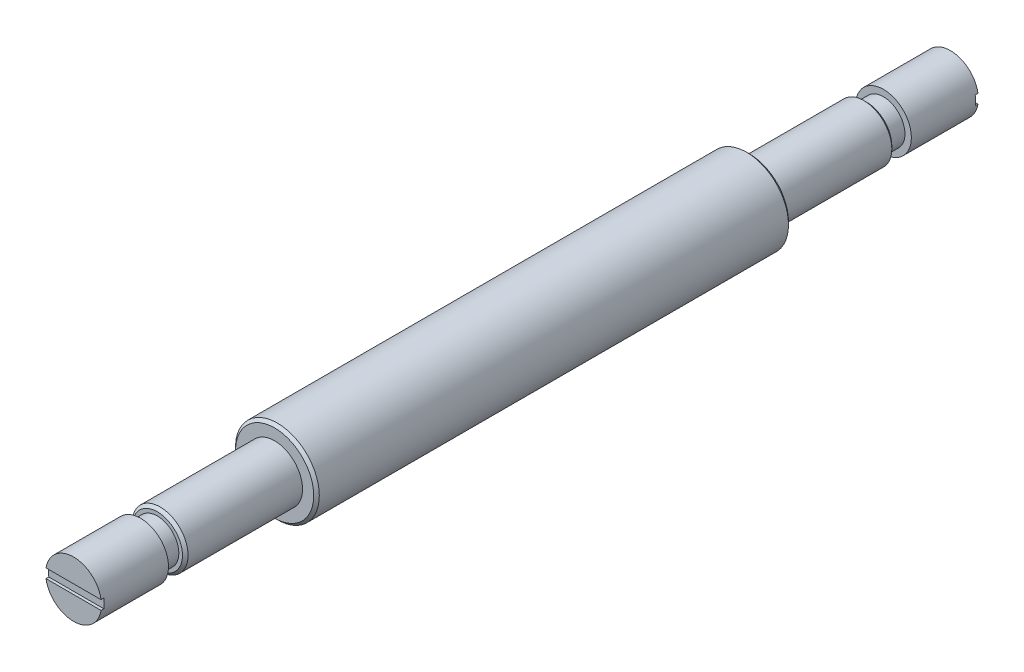
ISO-10303-21;
HEADER;
FILE_DESCRIPTION(('STEP AP214'),'2;1');
FILE_NAME('part.step','',(''),(''),'','','');
FILE_SCHEMA(('AUTOMOTIVE_DESIGN { 1 0 10303 214 1 1 1 1 }'));
ENDSEC;
DATA;
#1=APPLICATION_CONTEXT('core data for automotive mechanical design processes');
#2=APPLICATION_PROTOCOL_DEFINITION('international standard','automotive_design',2000,#1);
#3=PRODUCT_CONTEXT('',#1,'mechanical');
#4=PRODUCT('Part','Part','',(#3));
#5=PRODUCT_RELATED_PRODUCT_CATEGORY('part','',(#4));
#6=PRODUCT_DEFINITION_FORMATION('','',#4);
#7=PRODUCT_DEFINITION_CONTEXT('part definition',#1,'design');
#8=PRODUCT_DEFINITION('design','',#6,#7);
#9=PRODUCT_DEFINITION_SHAPE('','',#8);
#10=(LENGTH_UNIT() NAMED_UNIT(*) SI_UNIT(.MILLI.,.METRE.));
#11=(NAMED_UNIT(*) PLANE_ANGLE_UNIT() SI_UNIT($,.RADIAN.));
#12=(NAMED_UNIT(*) SI_UNIT($,.STERADIAN.) SOLID_ANGLE_UNIT());
#13=UNCERTAINTY_MEASURE_WITH_UNIT(LENGTH_MEASURE(1.E-05),#10,'distance_accuracy_value','');
#14=(GEOMETRIC_REPRESENTATION_CONTEXT(3) GLOBAL_UNCERTAINTY_ASSIGNED_CONTEXT((#13)) GLOBAL_UNIT_ASSIGNED_CONTEXT((#10,
#11,#12)) REPRESENTATION_CONTEXT('',''));
#15=CARTESIAN_POINT('',(0.,0.,0.));
#16=DIRECTION('',(0.,0.,1.));
#17=DIRECTION('',(1.,0.,0.));
#18=AXIS2_PLACEMENT_3D('',#15,#16,#17);
#19=CARTESIAN_POINT('',(0.,0.,78.5));
#20=DIRECTION('',(0.,0.,1.));
#21=DIRECTION('',(1.,0.,0.));
#22=AXIS2_PLACEMENT_3D('',#19,#20,#21);
#23=PLANE('',#22);
#24=CARTESIAN_POINT('',(0.,0.,78.5));
#25=DIRECTION('',(0.,0.,1.));
#26=DIRECTION('',(1.,0.,0.));
#27=AXIS2_PLACEMENT_3D('',#24,#25,#26);
#28=CIRCLE('',#27,5.);
#29=CARTESIAN_POINT('',(4.93036641759883,0.831556966306978,78.5));
#30=VERTEX_POINT('',#29);
#31=CARTESIAN_POINT('',(-4.93036641759883,0.831556966306978,78.5));
#32=VERTEX_POINT('',#31);
#33=EDGE_CURVE('E119',#30,#32,#28,.T.);
#34=ORIENTED_EDGE('',*,*,#33,.T.);
#35=DIRECTION('',(1.,0.,0.));
#36=VECTOR('',#35,1.);
#37=CARTESIAN_POINT('',(5.83331006214958,0.831556966306978,78.5));
#38=LINE('',#37,#36);
#39=EDGE_CURVE('E110',#32,#30,#38,.T.);
#40=ORIENTED_EDGE('',*,*,#39,.T.);
#41=EDGE_LOOP('',(#34,#40));
#42=FACE_BOUND('',#41,.T.);
#43=ADVANCED_FACE('F37',(#42),#23,.T.);
#44=CARTESIAN_POINT('',(-4.93036641759883,-0.831556966306978,78.5));
#45=VERTEX_POINT('',#44);
#46=CARTESIAN_POINT('',(4.93036641759883,-0.831556966306978,78.5));
#47=VERTEX_POINT('',#46);
#48=EDGE_CURVE('E116',#45,#47,#28,.T.);
#49=ORIENTED_EDGE('',*,*,#48,.T.);
#50=DIRECTION('',(-1.,0.,0.));
#51=VECTOR('',#50,1.);
#52=CARTESIAN_POINT('',(5.83331006214958,-0.831556966306978,78.5));
#53=LINE('',#52,#51);
#54=EDGE_CURVE('E100',#47,#45,#53,.T.);
#55=ORIENTED_EDGE('',*,*,#54,.T.);
#56=EDGE_LOOP('',(#49,#55));
#57=FACE_BOUND('',#56,.T.);
#58=ADVANCED_FACE('F118',(#57),#23,.T.);
#59=CARTESIAN_POINT('',(0.,0.,42.5));
#60=DIRECTION('',(0.,0.,1.));
#61=DIRECTION('',(1.,0.,0.));
#62=AXIS2_PLACEMENT_3D('',#59,#60,#61);
#63=CYLINDRICAL_SURFACE('',#62,5.);
#64=CARTESIAN_POINT('',(0.,0.,66.5));
#65=DIRECTION('',(0.,0.,1.));
#66=DIRECTION('',(1.,0.,0.));
#67=AXIS2_PLACEMENT_3D('',#64,#65,#66);
#68=CIRCLE('',#67,5.);
#69=CARTESIAN_POINT('',(5.,0.,66.5));
#70=VERTEX_POINT('',#69);
#71=EDGE_CURVE('E120',#70,#70,#68,.T.);
#72=ORIENTED_EDGE('',*,*,#71,.T.);
#73=EDGE_LOOP('',(#72));
#74=FACE_BOUND('',#73,.T.);
#75=DIRECTION('',(0.,0.,1.));
#76=VECTOR('',#75,1.);
#77=CARTESIAN_POINT('',(4.93036641759883,0.831556966306978,42.5));
#78=LINE('',#77,#76);
#79=CARTESIAN_POINT('',(4.93036641759883,0.831556966306978,78.));
#80=VERTEX_POINT('',#79);
#81=EDGE_CURVE('E11',#80,#30,#78,.T.);
#82=ORIENTED_EDGE('',*,*,#81,.F.);
#83=CARTESIAN_POINT('',(0.,0.,78.));
#84=DIRECTION('',(0.,0.,-1.));
#85=DIRECTION('',(-1.,0.,0.));
#86=AXIS2_PLACEMENT_3D('',#83,#84,#85);
#87=CIRCLE('',#86,5.);
#88=CARTESIAN_POINT('',(4.93036641759883,-0.831556966306978,78.));
#89=VERTEX_POINT('',#88);
#90=EDGE_CURVE('E117',#80,#89,#87,.T.);
#91=ORIENTED_EDGE('',*,*,#90,.T.);
#92=DIRECTION('',(0.,0.,1.));
#93=VECTOR('',#92,1.);
#94=CARTESIAN_POINT('',(4.93036641759883,-0.831556966306978,42.5));
#95=LINE('',#94,#93);
#96=EDGE_CURVE('E45',#47,#89,#95,.F.);
#97=ORIENTED_EDGE('',*,*,#96,.F.);
#98=ORIENTED_EDGE('',*,*,#48,.F.);
#99=DIRECTION('',(0.,0.,1.));
#100=VECTOR('',#99,1.);
#101=CARTESIAN_POINT('',(-4.93036641759883,-0.831556966306978,42.5));
#102=LINE('',#101,#100);
#103=CARTESIAN_POINT('',(-4.93036641759883,-0.831556966306978,78.));
#104=VERTEX_POINT('',#103);
#105=EDGE_CURVE('E106',#104,#45,#102,.T.);
#106=ORIENTED_EDGE('',*,*,#105,.F.);
#107=CARTESIAN_POINT('',(-4.93036641759883,0.831556966306978,78.));
#108=VERTEX_POINT('',#107);
#109=EDGE_CURVE('E165',#104,#108,#87,.T.);
#110=ORIENTED_EDGE('',*,*,#109,.T.);
#111=DIRECTION('',(0.,0.,1.));
#112=VECTOR('',#111,1.);
#113=CARTESIAN_POINT('',(-4.93036641759883,0.831556966306978,42.5));
#114=LINE('',#113,#112);
#115=EDGE_CURVE('E169',#32,#108,#114,.F.);
#116=ORIENTED_EDGE('',*,*,#115,.F.);
#117=ORIENTED_EDGE('',*,*,#33,.F.);
#118=EDGE_LOOP('',(#82,#91,#97,#98,#106,#110,#116,#117));
#119=FACE_BOUND('',#118,.T.);
#120=ADVANCED_FACE('F115',(#74,#119),#63,.T.);
#121=CARTESIAN_POINT('',(0.,0.,-78.5));
#122=DIRECTION('',(0.,0.,1.));
#123=DIRECTION('',(1.,0.,0.));
#124=AXIS2_PLACEMENT_3D('',#121,#122,#123);
#125=PLANE('',#124);
#126=CARTESIAN_POINT('',(0.,0.,-78.5));
#127=DIRECTION('',(0.,0.,1.));
#128=DIRECTION('',(1.,0.,0.));
#129=AXIS2_PLACEMENT_3D('',#126,#127,#128);
#130=CIRCLE('',#129,5.);
#131=CARTESIAN_POINT('',(-4.93036641759883,-0.831556966306978,-78.5));
#132=VERTEX_POINT('',#131);
#133=CARTESIAN_POINT('',(4.93036641759883,-0.831556966306978,-78.5));
#134=VERTEX_POINT('',#133);
#135=EDGE_CURVE('E207',#132,#134,#130,.T.);
#136=ORIENTED_EDGE('',*,*,#135,.F.);
#137=DIRECTION('',(-1.,0.,0.));
#138=VECTOR('',#137,1.);
#139=CARTESIAN_POINT('',(5.83331006214958,-0.831556966306978,-78.5));
#140=LINE('',#139,#138);
#141=EDGE_CURVE('E183',#134,#132,#140,.T.);
#142=ORIENTED_EDGE('',*,*,#141,.F.);
#143=EDGE_LOOP('',(#136,#142));
#144=FACE_BOUND('',#143,.T.);
#145=ADVANCED_FACE('F223',(#144),#125,.F.);
#146=CARTESIAN_POINT('',(4.93036641759883,0.831556966306978,-78.5));
#147=VERTEX_POINT('',#146);
#148=CARTESIAN_POINT('',(-4.93036641759883,0.831556966306978,-78.5));
#149=VERTEX_POINT('',#148);
#150=EDGE_CURVE('E133',#147,#149,#130,.T.);
#151=ORIENTED_EDGE('',*,*,#150,.F.);
#152=DIRECTION('',(1.,0.,0.));
#153=VECTOR('',#152,1.);
#154=CARTESIAN_POINT('',(5.83331006214958,0.831556966306978,-78.5));
#155=LINE('',#154,#153);
#156=EDGE_CURVE('E178',#149,#147,#155,.T.);
#157=ORIENTED_EDGE('',*,*,#156,.F.);
#158=EDGE_LOOP('',(#151,#157));
#159=FACE_BOUND('',#158,.T.);
#160=ADVANCED_FACE('F232',(#159),#125,.F.);
#161=CARTESIAN_POINT('',(0.,0.,42.5));
#162=DIRECTION('',(0.,0.,1.));
#163=DIRECTION('',(1.,0.,0.));
#164=AXIS2_PLACEMENT_3D('',#161,#162,#163);
#165=CYLINDRICAL_SURFACE('',#164,5.);
#166=DIRECTION('',(0.,0.,1.));
#167=VECTOR('',#166,1.);
#168=CARTESIAN_POINT('',(-4.93036641759883,-0.831556966306978,42.5));
#169=LINE('',#168,#167);
#170=CARTESIAN_POINT('',(-4.93036641759883,-0.831556966306978,-78.));
#171=VERTEX_POINT('',#170);
#172=EDGE_CURVE('E163',#132,#171,#169,.T.);
#173=ORIENTED_EDGE('',*,*,#172,.F.);
#174=ORIENTED_EDGE('',*,*,#135,.T.);
#175=DIRECTION('',(0.,0.,1.));
#176=VECTOR('',#175,1.);
#177=CARTESIAN_POINT('',(4.93036641759883,-0.831556966306978,42.5));
#178=LINE('',#177,#176);
#179=CARTESIAN_POINT('',(4.93036641759883,-0.831556966306978,-78.));
#180=VERTEX_POINT('',#179);
#181=EDGE_CURVE('E159',#180,#134,#178,.F.);
#182=ORIENTED_EDGE('',*,*,#181,.F.);
#183=CARTESIAN_POINT('',(0.,0.,-78.));
#184=DIRECTION('',(0.,0.,1.));
#185=DIRECTION('',(1.,0.,0.));
#186=AXIS2_PLACEMENT_3D('',#183,#184,#185);
#187=CIRCLE('',#186,5.);
#188=CARTESIAN_POINT('',(4.93036641759883,0.831556966306978,-78.));
#189=VERTEX_POINT('',#188);
#190=EDGE_CURVE('E154',#189,#180,#187,.F.);
#191=ORIENTED_EDGE('',*,*,#190,.F.);
#192=DIRECTION('',(0.,0.,1.));
#193=VECTOR('',#192,1.);
#194=CARTESIAN_POINT('',(4.93036641759883,0.831556966306978,42.5));
#195=LINE('',#194,#193);
#196=EDGE_CURVE('E156',#147,#189,#195,.T.);
#197=ORIENTED_EDGE('',*,*,#196,.F.);
#198=ORIENTED_EDGE('',*,*,#150,.T.);
#199=DIRECTION('',(0.,0.,1.));
#200=VECTOR('',#199,1.);
#201=CARTESIAN_POINT('',(-4.93036641759883,0.831556966306978,42.5));
#202=LINE('',#201,#200);
#203=CARTESIAN_POINT('',(-4.93036641759883,0.831556966306978,-78.));
#204=VERTEX_POINT('',#203);
#205=EDGE_CURVE('E161',#204,#149,#202,.F.);
#206=ORIENTED_EDGE('',*,*,#205,.F.);
#207=EDGE_CURVE('E157',#171,#204,#187,.F.);
#208=ORIENTED_EDGE('',*,*,#207,.F.);
#209=EDGE_LOOP('',(#173,#174,#182,#191,#197,#198,#206,#208));
#210=FACE_BOUND('',#209,.T.);
#211=CARTESIAN_POINT('',(0.,0.,-66.5));
#212=DIRECTION('',(0.,0.,1.));
#213=DIRECTION('',(1.,0.,0.));
#214=AXIS2_PLACEMENT_3D('',#211,#212,#213);
#215=CIRCLE('',#214,5.);
#216=CARTESIAN_POINT('',(5.,0.,-66.5));
#217=VERTEX_POINT('',#216);
#218=EDGE_CURVE('E205',#217,#217,#215,.T.);
#219=ORIENTED_EDGE('',*,*,#218,.F.);
#220=EDGE_LOOP('',(#219));
#221=FACE_BOUND('',#220,.T.);
#222=ADVANCED_FACE('F217',(#210,#221),#165,.T.);
#223=CARTESIAN_POINT('',(0.,0.,-66.5));
#224=DIRECTION('',(0.,0.,1.));
#225=DIRECTION('',(1.,0.,0.));
#226=AXIS2_PLACEMENT_3D('',#223,#224,#225);
#227=PLANE('',#226);
#228=ORIENTED_EDGE('',*,*,#218,.T.);
#229=EDGE_LOOP('',(#228));
#230=FACE_BOUND('',#229,.T.);
#231=CARTESIAN_POINT('',(0.,0.,-66.5));
#232=DIRECTION('',(0.,0.,1.));
#233=DIRECTION('',(1.,0.,0.));
#234=AXIS2_PLACEMENT_3D('',#231,#232,#233);
#235=CIRCLE('',#234,3.85);
#236=CARTESIAN_POINT('',(3.85,0.,-66.5));
#237=VERTEX_POINT('',#236);
#238=EDGE_CURVE('E202',#237,#237,#235,.T.);
#239=ORIENTED_EDGE('',*,*,#238,.F.);
#240=EDGE_LOOP('',(#239));
#241=FACE_BOUND('',#240,.T.);
#242=ADVANCED_FACE('F240',(#230,#241),#227,.T.);
#243=CARTESIAN_POINT('',(0.,0.,42.5));
#244=DIRECTION('',(0.,0.,1.));
#245=DIRECTION('',(1.,0.,0.));
#246=AXIS2_PLACEMENT_3D('',#243,#244,#245);
#247=CYLINDRICAL_SURFACE('',#246,3.85);
#248=ORIENTED_EDGE('',*,*,#238,.T.);
#249=EDGE_LOOP('',(#248));
#250=FACE_BOUND('',#249,.T.);
#251=CARTESIAN_POINT('',(0.,0.,-63.5));
#252=DIRECTION('',(0.,0.,1.));
#253=DIRECTION('',(1.,0.,0.));
#254=AXIS2_PLACEMENT_3D('',#251,#252,#253);
#255=CIRCLE('',#254,3.85);
#256=CARTESIAN_POINT('',(3.85,0.,-63.5));
#257=VERTEX_POINT('',#256);
#258=EDGE_CURVE('E199',#257,#257,#255,.T.);
#259=ORIENTED_EDGE('',*,*,#258,.F.);
#260=EDGE_LOOP('',(#259));
#261=FACE_BOUND('',#260,.T.);
#262=ADVANCED_FACE('F309',(#250,#261),#247,.T.);
#263=CARTESIAN_POINT('',(0.,0.,-63.5));
#264=DIRECTION('',(0.,0.,1.));
#265=DIRECTION('',(1.,0.,0.));
#266=AXIS2_PLACEMENT_3D('',#263,#264,#265);
#267=PLANE('',#266);
#268=CARTESIAN_POINT('',(0.,0.,-63.5));
#269=DIRECTION('',(0.,0.,1.));
#270=DIRECTION('',(1.,0.,0.));
#271=AXIS2_PLACEMENT_3D('',#268,#269,#270);
#272=CIRCLE('',#271,4.50000000000002);
#273=CARTESIAN_POINT('',(4.50000000000002,0.,-63.5));
#274=VERTEX_POINT('',#273);
#275=EDGE_CURVE('E139',#274,#274,#272,.F.);
#276=ORIENTED_EDGE('',*,*,#275,.T.);
#277=EDGE_LOOP('',(#276));
#278=FACE_BOUND('',#277,.T.);
#279=ORIENTED_EDGE('',*,*,#258,.T.);
#280=EDGE_LOOP('',(#279));
#281=FACE_BOUND('',#280,.T.);
#282=ADVANCED_FACE('F305',(#278,#281),#267,.F.);
#283=CARTESIAN_POINT('',(0.,0.,42.5));
#284=DIRECTION('',(0.,0.,1.));
#285=DIRECTION('',(1.,0.,0.));
#286=AXIS2_PLACEMENT_3D('',#283,#284,#285);
#287=CYLINDRICAL_SURFACE('',#286,5.);
#288=CARTESIAN_POINT('',(0.,0.,-63.));
#289=DIRECTION('',(0.,0.,1.));
#290=DIRECTION('',(1.,0.,0.));
#291=AXIS2_PLACEMENT_3D('',#288,#289,#290);
#292=CIRCLE('',#291,5.);
#293=CARTESIAN_POINT('',(5.,0.,-63.));
#294=VERTEX_POINT('',#293);
#295=EDGE_CURVE('E136',#294,#294,#292,.T.);
#296=ORIENTED_EDGE('',*,*,#295,.T.);
#297=EDGE_LOOP('',(#296));
#298=FACE_BOUND('',#297,.T.);
#299=CARTESIAN_POINT('',(0.,0.,-42.5));
#300=DIRECTION('',(0.,0.,1.));
#301=DIRECTION('',(1.,0.,0.));
#302=AXIS2_PLACEMENT_3D('',#299,#300,#301);
#303=CIRCLE('',#302,5.);
#304=CARTESIAN_POINT('',(5.,0.,-42.5));
#305=VERTEX_POINT('',#304);
#306=EDGE_CURVE('E196',#305,#305,#303,.T.);
#307=ORIENTED_EDGE('',*,*,#306,.F.);
#308=EDGE_LOOP('',(#307));
#309=FACE_BOUND('',#308,.T.);
#310=ADVANCED_FACE('F301',(#298,#309),#287,.T.);
#311=CARTESIAN_POINT('',(0.,0.,-42.5));
#312=DIRECTION('',(0.,0.,1.));
#313=DIRECTION('',(1.,0.,0.));
#314=AXIS2_PLACEMENT_3D('',#311,#312,#313);
#315=PLANE('',#314);
#316=CARTESIAN_POINT('',(0.,0.,-42.5));
#317=DIRECTION('',(0.,0.,1.));
#318=DIRECTION('',(1.,0.,0.));
#319=AXIS2_PLACEMENT_3D('',#316,#317,#318);
#320=CIRCLE('',#319,6.99999999999998);
#321=CARTESIAN_POINT('',(6.99999999999998,0.,-42.5));
#322=VERTEX_POINT('',#321);
#323=EDGE_CURVE('E148',#322,#322,#320,.F.);
#324=ORIENTED_EDGE('',*,*,#323,.T.);
#325=EDGE_LOOP('',(#324));
#326=FACE_BOUND('',#325,.T.);
#327=ORIENTED_EDGE('',*,*,#306,.T.);
#328=EDGE_LOOP('',(#327));
#329=FACE_BOUND('',#328,.T.);
#330=ADVANCED_FACE('F276',(#326,#329),#315,.F.);
#331=CARTESIAN_POINT('',(0.,0.,42.5));
#332=DIRECTION('',(0.,0.,1.));
#333=DIRECTION('',(1.,0.,0.));
#334=AXIS2_PLACEMENT_3D('',#331,#332,#333);
#335=CYLINDRICAL_SURFACE('',#334,7.5);
#336=CARTESIAN_POINT('',(0.,0.,-42.));
#337=DIRECTION('',(0.,0.,1.));
#338=DIRECTION('',(1.,0.,0.));
#339=AXIS2_PLACEMENT_3D('',#336,#337,#338);
#340=CIRCLE('',#339,7.5);
#341=CARTESIAN_POINT('',(7.5,0.,-42.));
#342=VERTEX_POINT('',#341);
#343=EDGE_CURVE('E145',#342,#342,#340,.T.);
#344=ORIENTED_EDGE('',*,*,#343,.T.);
#345=EDGE_LOOP('',(#344));
#346=FACE_BOUND('',#345,.T.);
#347=CARTESIAN_POINT('',(0.,0.,42.));
#348=DIRECTION('',(0.,0.,1.));
#349=DIRECTION('',(1.,0.,0.));
#350=AXIS2_PLACEMENT_3D('',#347,#348,#349);
#351=CIRCLE('',#350,7.5);
#352=CARTESIAN_POINT('',(7.5,0.,42.));
#353=VERTEX_POINT('',#352);
#354=EDGE_CURVE('E142',#353,#353,#351,.F.);
#355=ORIENTED_EDGE('',*,*,#354,.T.);
#356=EDGE_LOOP('',(#355));
#357=FACE_BOUND('',#356,.T.);
#358=ADVANCED_FACE('F272',(#346,#357),#335,.T.);
#359=CARTESIAN_POINT('',(0.,0.,42.5));
#360=DIRECTION('',(0.,0.,1.));
#361=DIRECTION('',(1.,0.,0.));
#362=AXIS2_PLACEMENT_3D('',#359,#360,#361);
#363=PLANE('',#362);
#364=CARTESIAN_POINT('',(0.,0.,42.5));
#365=DIRECTION('',(0.,0.,1.));
#366=DIRECTION('',(1.,0.,0.));
#367=AXIS2_PLACEMENT_3D('',#364,#365,#366);
#368=CIRCLE('',#367,6.99999999999998);
#369=CARTESIAN_POINT('',(6.99999999999998,0.,42.5));
#370=VERTEX_POINT('',#369);
#371=EDGE_CURVE('E151',#370,#370,#368,.T.);
#372=ORIENTED_EDGE('',*,*,#371,.T.);
#373=EDGE_LOOP('',(#372));
#374=FACE_BOUND('',#373,.T.);
#375=CARTESIAN_POINT('',(0.,0.,42.5));
#376=DIRECTION('',(0.,0.,1.));
#377=DIRECTION('',(1.,0.,0.));
#378=AXIS2_PLACEMENT_3D('',#375,#376,#377);
#379=CIRCLE('',#378,5.);
#380=CARTESIAN_POINT('',(5.,0.,42.5));
#381=VERTEX_POINT('',#380);
#382=EDGE_CURVE('E193',#381,#381,#379,.T.);
#383=ORIENTED_EDGE('',*,*,#382,.F.);
#384=EDGE_LOOP('',(#383));
#385=FACE_BOUND('',#384,.T.);
#386=ADVANCED_FACE('F275',(#374,#385),#363,.T.);
#387=CARTESIAN_POINT('',(0.,0.,42.5));
#388=DIRECTION('',(0.,0.,1.));
#389=DIRECTION('',(1.,0.,0.));
#390=AXIS2_PLACEMENT_3D('',#387,#388,#389);
#391=CYLINDRICAL_SURFACE('',#390,5.);
#392=CARTESIAN_POINT('',(0.,0.,63.));
#393=DIRECTION('',(0.,0.,1.));
#394=DIRECTION('',(1.,0.,0.));
#395=AXIS2_PLACEMENT_3D('',#392,#393,#394);
#396=CIRCLE('',#395,5.);
#397=CARTESIAN_POINT('',(5.,0.,63.));
#398=VERTEX_POINT('',#397);
#399=EDGE_CURVE('E132',#398,#398,#396,.F.);
#400=ORIENTED_EDGE('',*,*,#399,.T.);
#401=EDGE_LOOP('',(#400));
#402=FACE_BOUND('',#401,.T.);
#403=ORIENTED_EDGE('',*,*,#382,.T.);
#404=EDGE_LOOP('',(#403));
#405=FACE_BOUND('',#404,.T.);
#406=ADVANCED_FACE('F284',(#402,#405),#391,.T.);
#407=CARTESIAN_POINT('',(0.,0.,63.5));
#408=DIRECTION('',(0.,0.,1.));
#409=DIRECTION('',(1.,0.,0.));
#410=AXIS2_PLACEMENT_3D('',#407,#408,#409);
#411=PLANE('',#410);
#412=CARTESIAN_POINT('',(0.,0.,63.5));
#413=DIRECTION('',(0.,0.,1.));
#414=DIRECTION('',(1.,0.,0.));
#415=AXIS2_PLACEMENT_3D('',#412,#413,#414);
#416=CIRCLE('',#415,4.50000000000003);
#417=CARTESIAN_POINT('',(4.50000000000003,0.,63.5));
#418=VERTEX_POINT('',#417);
#419=EDGE_CURVE('E129',#418,#418,#416,.T.);
#420=ORIENTED_EDGE('',*,*,#419,.T.);
#421=EDGE_LOOP('',(#420));
#422=FACE_BOUND('',#421,.T.);
#423=CARTESIAN_POINT('',(0.,0.,63.5));
#424=DIRECTION('',(0.,0.,1.));
#425=DIRECTION('',(1.,0.,0.));
#426=AXIS2_PLACEMENT_3D('',#423,#424,#425);
#427=CIRCLE('',#426,3.85);
#428=CARTESIAN_POINT('',(3.85,0.,63.5));
#429=VERTEX_POINT('',#428);
#430=EDGE_CURVE('E190',#429,#429,#427,.T.);
#431=ORIENTED_EDGE('',*,*,#430,.F.);
#432=EDGE_LOOP('',(#431));
#433=FACE_BOUND('',#432,.T.);
#434=ADVANCED_FACE('F289',(#422,#433),#411,.T.);
#435=CARTESIAN_POINT('',(0.,0.,42.5));
#436=DIRECTION('',(0.,0.,1.));
#437=DIRECTION('',(1.,0.,0.));
#438=AXIS2_PLACEMENT_3D('',#435,#436,#437);
#439=CYLINDRICAL_SURFACE('',#438,3.85);
#440=CARTESIAN_POINT('',(0.,0.,66.5));
#441=DIRECTION('',(0.,0.,1.));
#442=DIRECTION('',(1.,0.,0.));
#443=AXIS2_PLACEMENT_3D('',#440,#441,#442);
#444=CIRCLE('',#443,3.85);
#445=CARTESIAN_POINT('',(3.85,0.,66.5));
#446=VERTEX_POINT('',#445);
#447=EDGE_CURVE('E123',#446,#446,#444,.T.);
#448=ORIENTED_EDGE('',*,*,#447,.F.);
#449=EDGE_LOOP('',(#448));
#450=FACE_BOUND('',#449,.T.);
#451=ORIENTED_EDGE('',*,*,#430,.T.);
#452=EDGE_LOOP('',(#451));
#453=FACE_BOUND('',#452,.T.);
#454=ADVANCED_FACE('F245',(#450,#453),#439,.T.);
#455=CARTESIAN_POINT('',(0.,0.,66.5));
#456=DIRECTION('',(0.,0.,1.));
#457=DIRECTION('',(1.,0.,0.));
#458=AXIS2_PLACEMENT_3D('',#455,#456,#457);
#459=PLANE('',#458);
#460=ORIENTED_EDGE('',*,*,#447,.T.);
#461=EDGE_LOOP('',(#460));
#462=FACE_BOUND('',#461,.T.);
#463=ORIENTED_EDGE('',*,*,#71,.F.);
#464=EDGE_LOOP('',(#463));
#465=FACE_BOUND('',#464,.T.);
#466=ADVANCED_FACE('F235',(#462,#465),#459,.F.);
#467=CARTESIAN_POINT('',(0.,0.,63.5));
#468=DIRECTION('',(0.,0.,-1.));
#469=DIRECTION('',(-1.,0.,0.));
#470=AXIS2_PLACEMENT_3D('',#467,#468,#469);
#471=CONICAL_SURFACE('',#470,4.50000000000003,0.785398163397444);
#472=ORIENTED_EDGE('',*,*,#399,.F.);
#473=EDGE_LOOP('',(#472));
#474=FACE_BOUND('',#473,.T.);
#475=ORIENTED_EDGE('',*,*,#419,.F.);
#476=EDGE_LOOP('',(#475));
#477=FACE_BOUND('',#476,.T.);
#478=ADVANCED_FACE('F244',(#474,#477),#471,.T.);
#479=CARTESIAN_POINT('',(0.,0.,-63.));
#480=DIRECTION('',(0.,0.,1.));
#481=DIRECTION('',(1.,0.,0.));
#482=AXIS2_PLACEMENT_3D('',#479,#480,#481);
#483=CONICAL_SURFACE('',#482,5.,0.78539816339743);
#484=ORIENTED_EDGE('',*,*,#275,.F.);
#485=EDGE_LOOP('',(#484));
#486=FACE_BOUND('',#485,.T.);
#487=ORIENTED_EDGE('',*,*,#295,.F.);
#488=EDGE_LOOP('',(#487));
#489=FACE_BOUND('',#488,.T.);
#490=ADVANCED_FACE('F257',(#486,#489),#483,.T.);
#491=CARTESIAN_POINT('',(0.,0.,-42.));
#492=DIRECTION('',(0.,0.,1.));
#493=DIRECTION('',(1.,0.,0.));
#494=AXIS2_PLACEMENT_3D('',#491,#492,#493);
#495=CONICAL_SURFACE('',#494,7.5,0.785398163397456);
#496=ORIENTED_EDGE('',*,*,#323,.F.);
#497=EDGE_LOOP('',(#496));
#498=FACE_BOUND('',#497,.T.);
#499=ORIENTED_EDGE('',*,*,#343,.F.);
#500=EDGE_LOOP('',(#499));
#501=FACE_BOUND('',#500,.T.);
#502=ADVANCED_FACE('F260',(#498,#501),#495,.T.);
#503=CARTESIAN_POINT('',(0.,0.,42.5));
#504=DIRECTION('',(0.,0.,-1.));
#505=DIRECTION('',(-1.,0.,0.));
#506=AXIS2_PLACEMENT_3D('',#503,#504,#505);
#507=CONICAL_SURFACE('',#506,6.99999999999998,0.785398163397449);
#508=ORIENTED_EDGE('',*,*,#354,.F.);
#509=EDGE_LOOP('',(#508));
#510=FACE_BOUND('',#509,.T.);
#511=ORIENTED_EDGE('',*,*,#371,.F.);
#512=EDGE_LOOP('',(#511));
#513=FACE_BOUND('',#512,.T.);
#514=ADVANCED_FACE('F39',(#510,#513),#507,.T.);
#515=CARTESIAN_POINT('',(5.83331006214958,-0.831556966306978,-78.));
#516=DIRECTION('',(0.,-1.,0.));
#517=DIRECTION('',(0.,0.,-1.));
#518=AXIS2_PLACEMENT_3D('',#515,#516,#517);
#519=PLANE('',#518);
#520=ORIENTED_EDGE('',*,*,#181,.T.);
#521=ORIENTED_EDGE('',*,*,#141,.T.);
#522=ORIENTED_EDGE('',*,*,#172,.T.);
#523=DIRECTION('',(-1.,0.,0.));
#524=VECTOR('',#523,1.);
#525=CARTESIAN_POINT('',(5.83331006214958,-0.831556966306978,-78.));
#526=LINE('',#525,#524);
#527=EDGE_CURVE('E125',#180,#171,#526,.T.);
#528=ORIENTED_EDGE('',*,*,#527,.F.);
#529=EDGE_LOOP('',(#520,#521,#522,#528));
#530=FACE_BOUND('',#529,.T.);
#531=ADVANCED_FACE('F225',(#530),#519,.F.);
#532=CARTESIAN_POINT('',(5.83331006214958,0.831556966306978,-78.));
#533=DIRECTION('',(0.,1.,0.));
#534=DIRECTION('',(0.,0.,1.));
#535=AXIS2_PLACEMENT_3D('',#532,#533,#534);
#536=PLANE('',#535);
#537=ORIENTED_EDGE('',*,*,#205,.T.);
#538=ORIENTED_EDGE('',*,*,#156,.T.);
#539=ORIENTED_EDGE('',*,*,#196,.T.);
#540=DIRECTION('',(1.,0.,0.));
#541=VECTOR('',#540,1.);
#542=CARTESIAN_POINT('',(5.83331006214958,0.831556966306978,-78.));
#543=LINE('',#542,#541);
#544=EDGE_CURVE('E60',#204,#189,#543,.T.);
#545=ORIENTED_EDGE('',*,*,#544,.F.);
#546=EDGE_LOOP('',(#537,#538,#539,#545));
#547=FACE_BOUND('',#546,.T.);
#548=ADVANCED_FACE('F230',(#547),#536,.F.);
#549=CARTESIAN_POINT('',(0.,0.,-78.));
#550=DIRECTION('',(0.,0.,1.));
#551=DIRECTION('',(1.,0.,0.));
#552=AXIS2_PLACEMENT_3D('',#549,#550,#551);
#553=PLANE('',#552);
#554=ORIENTED_EDGE('',*,*,#207,.T.);
#555=ORIENTED_EDGE('',*,*,#544,.T.);
#556=ORIENTED_EDGE('',*,*,#190,.T.);
#557=ORIENTED_EDGE('',*,*,#527,.T.);
#558=EDGE_LOOP('',(#554,#555,#556,#557));
#559=FACE_BOUND('',#558,.T.);
#560=ADVANCED_FACE('F227',(#559),#553,.F.);
#561=CARTESIAN_POINT('',(5.83331006214958,0.831556966306978,78.));
#562=DIRECTION('',(0.,-1.,0.));
#563=DIRECTION('',(0.,0.,-1.));
#564=AXIS2_PLACEMENT_3D('',#561,#562,#563);
#565=PLANE('',#564);
#566=ORIENTED_EDGE('',*,*,#81,.T.);
#567=ORIENTED_EDGE('',*,*,#39,.F.);
#568=ORIENTED_EDGE('',*,*,#115,.T.);
#569=DIRECTION('',(1.,0.,0.));
#570=VECTOR('',#569,1.);
#571=CARTESIAN_POINT('',(5.83331006214958,0.831556966306978,78.));
#572=LINE('',#571,#570);
#573=EDGE_CURVE('E52',#108,#80,#572,.T.);
#574=ORIENTED_EDGE('',*,*,#573,.T.);
#575=EDGE_LOOP('',(#566,#567,#568,#574));
#576=FACE_BOUND('',#575,.T.);
#577=ADVANCED_FACE('F172',(#576),#565,.T.);
#578=CARTESIAN_POINT('',(5.83331006214958,-0.831556966306978,78.));
#579=DIRECTION('',(0.,1.,0.));
#580=DIRECTION('',(0.,0.,1.));
#581=AXIS2_PLACEMENT_3D('',#578,#579,#580);
#582=PLANE('',#581);
#583=ORIENTED_EDGE('',*,*,#105,.T.);
#584=ORIENTED_EDGE('',*,*,#54,.F.);
#585=ORIENTED_EDGE('',*,*,#96,.T.);
#586=DIRECTION('',(-1.,0.,0.));
#587=VECTOR('',#586,1.);
#588=CARTESIAN_POINT('',(5.83331006214958,-0.831556966306978,78.));
#589=LINE('',#588,#587);
#590=EDGE_CURVE('E176',#89,#104,#589,.T.);
#591=ORIENTED_EDGE('',*,*,#590,.T.);
#592=EDGE_LOOP('',(#583,#584,#585,#591));
#593=FACE_BOUND('',#592,.T.);
#594=ADVANCED_FACE('F102',(#593),#582,.T.);
#595=CARTESIAN_POINT('',(0.,0.,78.));
#596=DIRECTION('',(0.,0.,-1.));
#597=DIRECTION('',(1.,0.,0.));
#598=AXIS2_PLACEMENT_3D('',#595,#596,#597);
#599=PLANE('',#598);
#600=ORIENTED_EDGE('',*,*,#573,.F.);
#601=ORIENTED_EDGE('',*,*,#109,.F.);
#602=ORIENTED_EDGE('',*,*,#590,.F.);
#603=ORIENTED_EDGE('',*,*,#90,.F.);
#604=EDGE_LOOP('',(#600,#601,#602,#603));
#605=FACE_BOUND('',#604,.T.);
#606=ADVANCED_FACE('F175',(#605),#599,.F.);
#607=CLOSED_SHELL('',(#43,#58,#120,#145,#160,#222,#242,#262,#282,#310,#330,#358,#386,#406,#434,
#454,#466,#478,#490,#502,#514,#531,#548,#560,#577,#594,#606));
#608=MANIFOLD_SOLID_BREP('B2',#607);
#609=ADVANCED_BREP_SHAPE_REPRESENTATION('',(#18,#608),#14);
#610=SHAPE_DEFINITION_REPRESENTATION(#9,#609);
ENDSEC;
END-ISO-10303-21;
